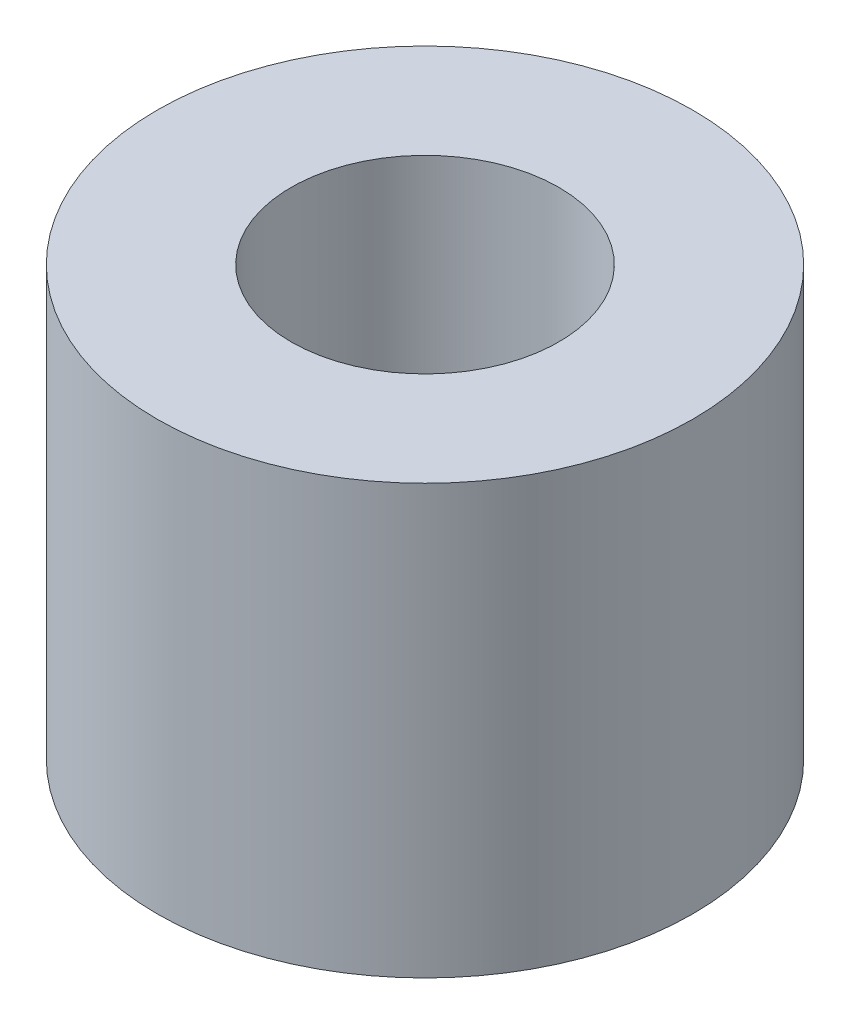
ISO-10303-21;
HEADER;
FILE_DESCRIPTION(('STEP AP214'),'2;1');
FILE_NAME('part.step','',(''),(''),'','','');
FILE_SCHEMA(('AUTOMOTIVE_DESIGN { 1 0 10303 214 1 1 1 1 }'));
ENDSEC;
DATA;
#1=APPLICATION_CONTEXT('core data for automotive mechanical design processes');
#2=APPLICATION_PROTOCOL_DEFINITION('international standard','automotive_design',2000,#1);
#3=PRODUCT_CONTEXT('',#1,'mechanical');
#4=PRODUCT('Part','Part','',(#3));
#5=PRODUCT_RELATED_PRODUCT_CATEGORY('part','',(#4));
#6=PRODUCT_DEFINITION_FORMATION('','',#4);
#7=PRODUCT_DEFINITION_CONTEXT('part definition',#1,'design');
#8=PRODUCT_DEFINITION('design','',#6,#7);
#9=PRODUCT_DEFINITION_SHAPE('','',#8);
#10=(LENGTH_UNIT() NAMED_UNIT(*) SI_UNIT(.MILLI.,.METRE.));
#11=(NAMED_UNIT(*) PLANE_ANGLE_UNIT() SI_UNIT($,.RADIAN.));
#12=(NAMED_UNIT(*) SI_UNIT($,.STERADIAN.) SOLID_ANGLE_UNIT());
#13=UNCERTAINTY_MEASURE_WITH_UNIT(LENGTH_MEASURE(1.E-05),#10,'distance_accuracy_value','');
#14=(GEOMETRIC_REPRESENTATION_CONTEXT(3) GLOBAL_UNCERTAINTY_ASSIGNED_CONTEXT((#13)) GLOBAL_UNIT_ASSIGNED_CONTEXT((#10,
#11,#12)) REPRESENTATION_CONTEXT('',''));
#15=CARTESIAN_POINT('',(0.,0.,0.));
#16=DIRECTION('',(0.,0.,1.));
#17=DIRECTION('',(1.,0.,0.));
#18=AXIS2_PLACEMENT_3D('',#15,#16,#17);
#19=CARTESIAN_POINT('',(0.,12.7,0.));
#20=DIRECTION('',(0.,-1.,0.));
#21=DIRECTION('',(0.,0.,-1.));
#22=AXIS2_PLACEMENT_3D('',#19,#20,#21);
#23=CYLINDRICAL_SURFACE('',#22,7.9375);
#24=CARTESIAN_POINT('',(0.,12.7,0.));
#25=DIRECTION('',(0.,1.,0.));
#26=DIRECTION('',(0.,0.,1.));
#27=AXIS2_PLACEMENT_3D('',#24,#25,#26);
#28=CIRCLE('',#27,7.9375);
#29=CARTESIAN_POINT('',(0.,12.7,7.9375));
#30=VERTEX_POINT('',#29);
#31=EDGE_CURVE('E10',#30,#30,#28,.T.);
#32=ORIENTED_EDGE('',*,*,#31,.F.);
#33=EDGE_LOOP('',(#32));
#34=FACE_BOUND('',#33,.T.);
#35=CARTESIAN_POINT('',(0.,0.,0.));
#36=DIRECTION('',(0.,1.,0.));
#37=DIRECTION('',(0.,0.,1.));
#38=AXIS2_PLACEMENT_3D('',#35,#36,#37);
#39=CIRCLE('',#38,7.9375);
#40=CARTESIAN_POINT('',(0.,0.,7.9375));
#41=VERTEX_POINT('',#40);
#42=EDGE_CURVE('E36',#41,#41,#39,.T.);
#43=ORIENTED_EDGE('',*,*,#42,.T.);
#44=EDGE_LOOP('',(#43));
#45=FACE_BOUND('',#44,.T.);
#46=ADVANCED_FACE('F33',(#34,#45),#23,.T.);
#47=CARTESIAN_POINT('',(0.,12.7,0.));
#48=DIRECTION('',(0.,1.,0.));
#49=DIRECTION('',(0.,0.,1.));
#50=AXIS2_PLACEMENT_3D('',#47,#48,#49);
#51=PLANE('',#50);
#52=CARTESIAN_POINT('',(0.,12.7,0.));
#53=DIRECTION('',(0.,1.,0.));
#54=DIRECTION('',(0.,0.,1.));
#55=AXIS2_PLACEMENT_3D('',#52,#53,#54);
#56=CIRCLE('',#55,3.96875);
#57=CARTESIAN_POINT('',(0.,12.7,3.96875));
#58=VERTEX_POINT('',#57);
#59=EDGE_CURVE('E47',#58,#58,#56,.T.);
#60=ORIENTED_EDGE('',*,*,#59,.F.);
#61=EDGE_LOOP('',(#60));
#62=FACE_BOUND('',#61,.T.);
#63=ORIENTED_EDGE('',*,*,#31,.T.);
#64=EDGE_LOOP('',(#63));
#65=FACE_BOUND('',#64,.T.);
#66=ADVANCED_FACE('F53',(#62,#65),#51,.T.);
#67=CARTESIAN_POINT('',(0.,0.,0.));
#68=DIRECTION('',(0.,1.,0.));
#69=DIRECTION('',(0.,0.,1.));
#70=AXIS2_PLACEMENT_3D('',#67,#68,#69);
#71=PLANE('',#70);
#72=ORIENTED_EDGE('',*,*,#42,.F.);
#73=EDGE_LOOP('',(#72));
#74=FACE_BOUND('',#73,.T.);
#75=ADVANCED_FACE('F55',(#74),#71,.F.);
#76=CARTESIAN_POINT('',(0.,1.524,0.));
#77=DIRECTION('',(0.,-1.,0.));
#78=DIRECTION('',(0.,0.,-1.));
#79=AXIS2_PLACEMENT_3D('',#76,#77,#78);
#80=PLANE('',#79);
#81=CARTESIAN_POINT('',(0.,1.524,0.));
#82=DIRECTION('',(0.,1.,0.));
#83=DIRECTION('',(0.,0.,1.));
#84=AXIS2_PLACEMENT_3D('',#81,#82,#83);
#85=CIRCLE('',#84,3.96875);
#86=CARTESIAN_POINT('',(0.,1.524,3.96875));
#87=VERTEX_POINT('',#86);
#88=EDGE_CURVE('E43',#87,#87,#85,.T.);
#89=ORIENTED_EDGE('',*,*,#88,.T.);
#90=EDGE_LOOP('',(#89));
#91=FACE_BOUND('',#90,.T.);
#92=ADVANCED_FACE('F61',(#91),#80,.F.);
#93=CARTESIAN_POINT('',(0.,12.7,0.));
#94=DIRECTION('',(0.,1.,0.));
#95=DIRECTION('',(0.,0.,1.));
#96=AXIS2_PLACEMENT_3D('',#93,#94,#95);
#97=CYLINDRICAL_SURFACE('',#96,3.96875);
#98=ORIENTED_EDGE('',*,*,#88,.F.);
#99=EDGE_LOOP('',(#98));
#100=FACE_BOUND('',#99,.T.);
#101=ORIENTED_EDGE('',*,*,#59,.T.);
#102=EDGE_LOOP('',(#101));
#103=FACE_BOUND('',#102,.T.);
#104=ADVANCED_FACE('F51',(#100,#103),#97,.F.);
#105=CLOSED_SHELL('',(#46,#66,#75,#92,#104));
#106=MANIFOLD_SOLID_BREP('B2',#105);
#107=ADVANCED_BREP_SHAPE_REPRESENTATION('',(#18,#106),#14);
#108=SHAPE_DEFINITION_REPRESENTATION(#9,#107);
ENDSEC;
END-ISO-10303-21;
